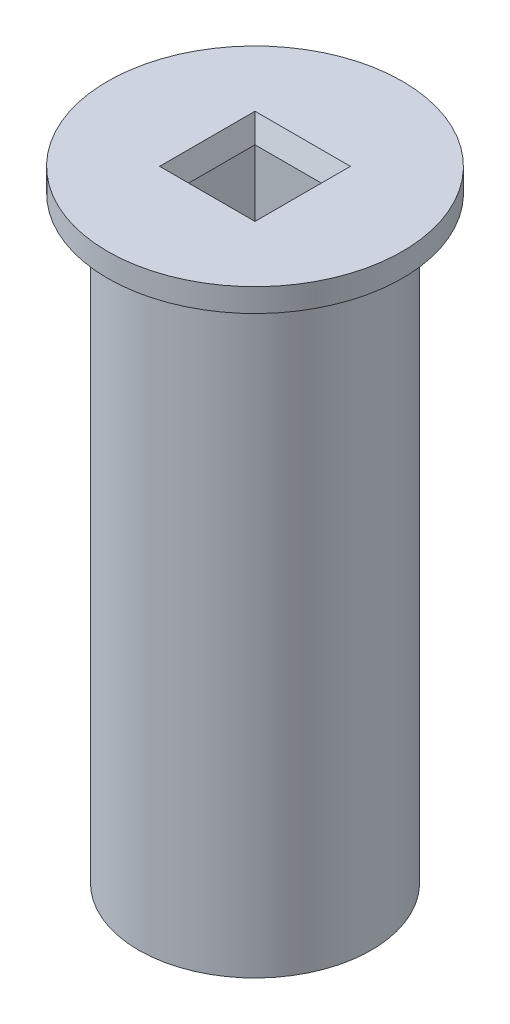
ISO-10303-21;
HEADER;
FILE_DESCRIPTION(('STEP AP214'),'2;1');
FILE_NAME('part.step','',(''),(''),'','','');
FILE_SCHEMA(('AUTOMOTIVE_DESIGN { 1 0 10303 214 1 1 1 1 }'));
ENDSEC;
DATA;
#1=APPLICATION_CONTEXT('core data for automotive mechanical design processes');
#2=APPLICATION_PROTOCOL_DEFINITION('international standard','automotive_design',2000,#1);
#3=PRODUCT_CONTEXT('',#1,'mechanical');
#4=PRODUCT('Part','Part','',(#3));
#5=PRODUCT_RELATED_PRODUCT_CATEGORY('part','',(#4));
#6=PRODUCT_DEFINITION_FORMATION('','',#4);
#7=PRODUCT_DEFINITION_CONTEXT('part definition',#1,'design');
#8=PRODUCT_DEFINITION('design','',#6,#7);
#9=PRODUCT_DEFINITION_SHAPE('','',#8);
#10=(LENGTH_UNIT() NAMED_UNIT(*) SI_UNIT(.MILLI.,.METRE.));
#11=(NAMED_UNIT(*) PLANE_ANGLE_UNIT() SI_UNIT($,.RADIAN.));
#12=(NAMED_UNIT(*) SI_UNIT($,.STERADIAN.) SOLID_ANGLE_UNIT());
#13=UNCERTAINTY_MEASURE_WITH_UNIT(LENGTH_MEASURE(1.E-05),#10,'distance_accuracy_value','');
#14=(GEOMETRIC_REPRESENTATION_CONTEXT(3) GLOBAL_UNCERTAINTY_ASSIGNED_CONTEXT((#13)) GLOBAL_UNIT_ASSIGNED_CONTEXT((#10,
#11,#12)) REPRESENTATION_CONTEXT('',''));
#15=CARTESIAN_POINT('',(0.,0.,0.));
#16=DIRECTION('',(0.,0.,1.));
#17=DIRECTION('',(1.,0.,0.));
#18=AXIS2_PLACEMENT_3D('',#15,#16,#17);
#19=CARTESIAN_POINT('',(0.,80.,0.));
#20=DIRECTION('',(0.,-1.,0.));
#21=DIRECTION('',(0.,0.,-1.));
#22=AXIS2_PLACEMENT_3D('',#19,#20,#21);
#23=CYLINDRICAL_SURFACE('',#22,15.);
#24=CARTESIAN_POINT('',(0.,0.,0.));
#25=DIRECTION('',(0.,1.,0.));
#26=DIRECTION('',(0.,0.,1.));
#27=AXIS2_PLACEMENT_3D('',#24,#25,#26);
#28=CIRCLE('',#27,15.);
#29=CARTESIAN_POINT('',(0.,0.,15.));
#30=VERTEX_POINT('',#29);
#31=EDGE_CURVE('E94',#30,#30,#28,.T.);
#32=ORIENTED_EDGE('',*,*,#31,.T.);
#33=EDGE_LOOP('',(#32));
#34=FACE_BOUND('',#33,.T.);
#35=CARTESIAN_POINT('',(0.,77.,0.));
#36=DIRECTION('',(0.,1.,0.));
#37=DIRECTION('',(0.,0.,1.));
#38=AXIS2_PLACEMENT_3D('',#35,#36,#37);
#39=CIRCLE('',#38,15.);
#40=CARTESIAN_POINT('',(0.,77.,15.));
#41=VERTEX_POINT('',#40);
#42=EDGE_CURVE('E115',#41,#41,#39,.T.);
#43=ORIENTED_EDGE('',*,*,#42,.F.);
#44=EDGE_LOOP('',(#43));
#45=FACE_BOUND('',#44,.T.);
#46=ADVANCED_FACE('F35',(#34,#45),#23,.T.);
#47=CARTESIAN_POINT('',(0.,80.,0.));
#48=DIRECTION('',(0.,1.,0.));
#49=DIRECTION('',(0.,0.,1.));
#50=AXIS2_PLACEMENT_3D('',#47,#48,#49);
#51=PLANE('',#50);
#52=DIRECTION('',(1.,0.,0.));
#53=VECTOR('',#52,1.);
#54=CARTESIAN_POINT('',(0.,80.,-6.14999999999999));
#55=LINE('',#54,#53);
#56=CARTESIAN_POINT('',(-6.14999999999999,80.,-6.14999999999999));
#57=VERTEX_POINT('',#56);
#58=CARTESIAN_POINT('',(6.15,80.,-6.14999999999999));
#59=VERTEX_POINT('',#58);
#60=EDGE_CURVE('E130',#57,#59,#55,.T.);
#61=ORIENTED_EDGE('',*,*,#60,.T.);
#62=DIRECTION('',(0.,0.,1.));
#63=VECTOR('',#62,1.);
#64=CARTESIAN_POINT('',(6.15,80.,0.));
#65=LINE('',#64,#63);
#66=CARTESIAN_POINT('',(6.15,80.,6.15));
#67=VERTEX_POINT('',#66);
#68=EDGE_CURVE('E136',#59,#67,#65,.T.);
#69=ORIENTED_EDGE('',*,*,#68,.T.);
#70=DIRECTION('',(-1.,0.,0.));
#71=VECTOR('',#70,1.);
#72=CARTESIAN_POINT('',(0.,80.,6.15));
#73=LINE('',#72,#71);
#74=CARTESIAN_POINT('',(-6.14999999999999,80.,6.15));
#75=VERTEX_POINT('',#74);
#76=EDGE_CURVE('E134',#67,#75,#73,.T.);
#77=ORIENTED_EDGE('',*,*,#76,.T.);
#78=DIRECTION('',(0.,0.,-1.));
#79=VECTOR('',#78,1.);
#80=CARTESIAN_POINT('',(-6.14999999999999,80.,0.));
#81=LINE('',#80,#79);
#82=EDGE_CURVE('E132',#75,#57,#81,.T.);
#83=ORIENTED_EDGE('',*,*,#82,.T.);
#84=EDGE_LOOP('',(#61,#69,#77,#83));
#85=FACE_BOUND('',#84,.T.);
#86=CARTESIAN_POINT('',(0.,80.,0.));
#87=DIRECTION('',(0.,1.,0.));
#88=DIRECTION('',(0.,0.,1.));
#89=AXIS2_PLACEMENT_3D('',#86,#87,#88);
#90=CIRCLE('',#89,19.);
#91=CARTESIAN_POINT('',(0.,80.,19.));
#92=VERTEX_POINT('',#91);
#93=EDGE_CURVE('E112',#92,#92,#90,.T.);
#94=ORIENTED_EDGE('',*,*,#93,.T.);
#95=EDGE_LOOP('',(#94));
#96=FACE_BOUND('',#95,.T.);
#97=ADVANCED_FACE('F157',(#85,#96),#51,.T.);
#98=CARTESIAN_POINT('',(0.,0.,0.));
#99=DIRECTION('',(0.,1.,0.));
#100=DIRECTION('',(0.,0.,1.));
#101=AXIS2_PLACEMENT_3D('',#98,#99,#100);
#102=PLANE('',#101);
#103=ORIENTED_EDGE('',*,*,#31,.F.);
#104=EDGE_LOOP('',(#103));
#105=FACE_BOUND('',#104,.T.);
#106=DIRECTION('',(0.,0.,1.));
#107=VECTOR('',#106,1.);
#108=CARTESIAN_POINT('',(-5.15,0.,5.15));
#109=LINE('',#108,#107);
#110=CARTESIAN_POINT('',(-5.15,0.,-5.15));
#111=VERTEX_POINT('',#110);
#112=CARTESIAN_POINT('',(-5.15,0.,5.15));
#113=VERTEX_POINT('',#112);
#114=EDGE_CURVE('E90',#111,#113,#109,.T.);
#115=ORIENTED_EDGE('',*,*,#114,.T.);
#116=DIRECTION('',(1.,0.,0.));
#117=VECTOR('',#116,1.);
#118=CARTESIAN_POINT('',(5.15,0.,5.15));
#119=LINE('',#118,#117);
#120=CARTESIAN_POINT('',(5.15,0.,5.15));
#121=VERTEX_POINT('',#120);
#122=EDGE_CURVE('E98',#113,#121,#119,.T.);
#123=ORIENTED_EDGE('',*,*,#122,.T.);
#124=DIRECTION('',(0.,0.,-1.));
#125=VECTOR('',#124,1.);
#126=CARTESIAN_POINT('',(5.15,0.,5.15));
#127=LINE('',#126,#125);
#128=CARTESIAN_POINT('',(5.15,0.,-5.15));
#129=VERTEX_POINT('',#128);
#130=EDGE_CURVE('E104',#121,#129,#127,.T.);
#131=ORIENTED_EDGE('',*,*,#130,.T.);
#132=DIRECTION('',(-1.,0.,0.));
#133=VECTOR('',#132,1.);
#134=CARTESIAN_POINT('',(5.15,0.,-5.15));
#135=LINE('',#134,#133);
#136=EDGE_CURVE('E108',#129,#111,#135,.T.);
#137=ORIENTED_EDGE('',*,*,#136,.T.);
#138=EDGE_LOOP('',(#115,#123,#131,#137));
#139=FACE_BOUND('',#138,.T.);
#140=ADVANCED_FACE('F106',(#105,#139),#102,.F.);
#141=CARTESIAN_POINT('',(-5.15,80.,5.15));
#142=DIRECTION('',(1.,0.,0.));
#143=DIRECTION('',(0.,0.,-1.));
#144=AXIS2_PLACEMENT_3D('',#141,#142,#143);
#145=PLANE('',#144);
#146=DIRECTION('',(0.,-1.,0.));
#147=VECTOR('',#146,1.);
#148=CARTESIAN_POINT('',(-5.15,80.,-5.15));
#149=LINE('',#148,#147);
#150=CARTESIAN_POINT('',(-5.15,77.2525225805454,-5.15));
#151=VERTEX_POINT('',#150);
#152=EDGE_CURVE('E120',#151,#111,#149,.T.);
#153=ORIENTED_EDGE('',*,*,#152,.F.);
#154=DIRECTION('',(0.,0.,1.));
#155=VECTOR('',#154,1.);
#156=CARTESIAN_POINT('',(-5.15,77.2525225805454,5.15));
#157=LINE('',#156,#155);
#158=CARTESIAN_POINT('',(-5.15,77.2525225805454,5.15));
#159=VERTEX_POINT('',#158);
#160=EDGE_CURVE('E44',#151,#159,#157,.T.);
#161=ORIENTED_EDGE('',*,*,#160,.T.);
#162=DIRECTION('',(0.,-1.,0.));
#163=VECTOR('',#162,1.);
#164=CARTESIAN_POINT('',(-5.15,80.,5.15));
#165=LINE('',#164,#163);
#166=EDGE_CURVE('E86',#159,#113,#165,.T.);
#167=ORIENTED_EDGE('',*,*,#166,.T.);
#168=ORIENTED_EDGE('',*,*,#114,.F.);
#169=EDGE_LOOP('',(#153,#161,#167,#168));
#170=FACE_BOUND('',#169,.T.);
#171=ADVANCED_FACE('F88',(#170),#145,.T.);
#172=CARTESIAN_POINT('',(5.15,80.,5.15));
#173=DIRECTION('',(0.,0.,-1.));
#174=DIRECTION('',(-1.,0.,0.));
#175=AXIS2_PLACEMENT_3D('',#172,#173,#174);
#176=PLANE('',#175);
#177=ORIENTED_EDGE('',*,*,#166,.F.);
#178=DIRECTION('',(1.,0.,0.));
#179=VECTOR('',#178,1.);
#180=CARTESIAN_POINT('',(5.15,77.2525225805454,5.15));
#181=LINE('',#180,#179);
#182=CARTESIAN_POINT('',(5.15,77.2525225805454,5.15));
#183=VERTEX_POINT('',#182);
#184=EDGE_CURVE('E139',#159,#183,#181,.T.);
#185=ORIENTED_EDGE('',*,*,#184,.T.);
#186=DIRECTION('',(0.,-1.,0.));
#187=VECTOR('',#186,1.);
#188=CARTESIAN_POINT('',(5.15,80.,5.15));
#189=LINE('',#188,#187);
#190=EDGE_CURVE('E95',#183,#121,#189,.T.);
#191=ORIENTED_EDGE('',*,*,#190,.T.);
#192=ORIENTED_EDGE('',*,*,#122,.F.);
#193=EDGE_LOOP('',(#177,#185,#191,#192));
#194=FACE_BOUND('',#193,.T.);
#195=ADVANCED_FACE('F99',(#194),#176,.T.);
#196=CARTESIAN_POINT('',(5.15,80.,5.15));
#197=DIRECTION('',(-1.,0.,0.));
#198=DIRECTION('',(0.,0.,1.));
#199=AXIS2_PLACEMENT_3D('',#196,#197,#198);
#200=PLANE('',#199);
#201=ORIENTED_EDGE('',*,*,#190,.F.);
#202=DIRECTION('',(0.,0.,-1.));
#203=VECTOR('',#202,1.);
#204=CARTESIAN_POINT('',(5.15,77.2525225805454,5.15));
#205=LINE('',#204,#203);
#206=CARTESIAN_POINT('',(5.15,77.2525225805454,-5.15));
#207=VERTEX_POINT('',#206);
#208=EDGE_CURVE('E127',#183,#207,#205,.T.);
#209=ORIENTED_EDGE('',*,*,#208,.T.);
#210=DIRECTION('',(0.,-1.,0.));
#211=VECTOR('',#210,1.);
#212=CARTESIAN_POINT('',(5.15,80.,-5.15));
#213=LINE('',#212,#211);
#214=EDGE_CURVE('E122',#207,#129,#213,.T.);
#215=ORIENTED_EDGE('',*,*,#214,.T.);
#216=ORIENTED_EDGE('',*,*,#130,.F.);
#217=EDGE_LOOP('',(#201,#209,#215,#216));
#218=FACE_BOUND('',#217,.T.);
#219=ADVANCED_FACE('F246',(#218),#200,.T.);
#220=CARTESIAN_POINT('',(5.15,80.,-5.15));
#221=DIRECTION('',(0.,0.,1.));
#222=DIRECTION('',(1.,0.,0.));
#223=AXIS2_PLACEMENT_3D('',#220,#221,#222);
#224=PLANE('',#223);
#225=ORIENTED_EDGE('',*,*,#214,.F.);
#226=DIRECTION('',(-1.,0.,0.));
#227=VECTOR('',#226,1.);
#228=CARTESIAN_POINT('',(5.15,77.2525225805454,-5.15));
#229=LINE('',#228,#227);
#230=EDGE_CURVE('E11',#207,#151,#229,.T.);
#231=ORIENTED_EDGE('',*,*,#230,.T.);
#232=ORIENTED_EDGE('',*,*,#152,.T.);
#233=ORIENTED_EDGE('',*,*,#136,.F.);
#234=EDGE_LOOP('',(#225,#231,#232,#233));
#235=FACE_BOUND('',#234,.T.);
#236=ADVANCED_FACE('F170',(#235),#224,.T.);
#237=CARTESIAN_POINT('',(0.,77.,0.));
#238=DIRECTION('',(0.,1.,0.));
#239=DIRECTION('',(0.,0.,1.));
#240=AXIS2_PLACEMENT_3D('',#237,#238,#239);
#241=PLANE('',#240);
#242=CARTESIAN_POINT('',(0.,77.,0.));
#243=DIRECTION('',(0.,1.,0.));
#244=DIRECTION('',(0.,0.,1.));
#245=AXIS2_PLACEMENT_3D('',#242,#243,#244);
#246=CIRCLE('',#245,19.);
#247=CARTESIAN_POINT('',(0.,77.,19.));
#248=VERTEX_POINT('',#247);
#249=EDGE_CURVE('E109',#248,#248,#246,.T.);
#250=ORIENTED_EDGE('',*,*,#249,.F.);
#251=EDGE_LOOP('',(#250));
#252=FACE_BOUND('',#251,.T.);
#253=ORIENTED_EDGE('',*,*,#42,.T.);
#254=EDGE_LOOP('',(#253));
#255=FACE_BOUND('',#254,.T.);
#256=ADVANCED_FACE('F161',(#252,#255),#241,.F.);
#257=CARTESIAN_POINT('',(0.,77.,0.));
#258=DIRECTION('',(0.,1.,0.));
#259=DIRECTION('',(0.,0.,1.));
#260=AXIS2_PLACEMENT_3D('',#257,#258,#259);
#261=CYLINDRICAL_SURFACE('',#260,19.);
#262=ORIENTED_EDGE('',*,*,#249,.T.);
#263=EDGE_LOOP('',(#262));
#264=FACE_BOUND('',#263,.T.);
#265=ORIENTED_EDGE('',*,*,#93,.F.);
#266=EDGE_LOOP('',(#265));
#267=FACE_BOUND('',#266,.T.);
#268=ADVANCED_FACE('F159',(#264,#267),#261,.T.);
#269=CARTESIAN_POINT('',(-5.15,77.2525225805454,5.15));
#270=DIRECTION('',(-0.939692620785909,-0.342020143325667,0.));
#271=DIRECTION('',(0.,0.,1.));
#272=AXIS2_PLACEMENT_3D('',#269,#270,#271);
#273=PLANE('',#272);
#274=DIRECTION('',(0.323615577118183,-0.889126490715989,0.323615577118183));
#275=VECTOR('',#274,1.);
#276=CARTESIAN_POINT('',(-4.07131146993859,74.2888502015769,-4.07131146993859));
#277=LINE('',#276,#275);
#278=EDGE_CURVE('E145',#57,#151,#277,.T.);
#279=ORIENTED_EDGE('',*,*,#278,.F.);
#280=ORIENTED_EDGE('',*,*,#82,.F.);
#281=DIRECTION('',(0.323615577118183,-0.889126490715989,-0.323615577118183));
#282=VECTOR('',#281,1.);
#283=CARTESIAN_POINT('',(-4.07131146993859,74.2888502015769,4.07131146993859));
#284=LINE('',#283,#282);
#285=EDGE_CURVE('E39',#159,#75,#284,.F.);
#286=ORIENTED_EDGE('',*,*,#285,.F.);
#287=ORIENTED_EDGE('',*,*,#160,.F.);
#288=EDGE_LOOP('',(#279,#280,#286,#287));
#289=FACE_BOUND('',#288,.T.);
#290=ADVANCED_FACE('F37',(#289),#273,.F.);
#291=CARTESIAN_POINT('',(5.15,77.2525225805454,5.15));
#292=DIRECTION('',(0.,-0.342020143325667,0.939692620785909));
#293=DIRECTION('',(1.,0.,0.));
#294=AXIS2_PLACEMENT_3D('',#291,#292,#293);
#295=PLANE('',#294);
#296=ORIENTED_EDGE('',*,*,#285,.T.);
#297=ORIENTED_EDGE('',*,*,#76,.F.);
#298=DIRECTION('',(-0.323615577118183,-0.889126490715989,-0.323615577118183));
#299=VECTOR('',#298,1.);
#300=CARTESIAN_POINT('',(5.15,77.2525225805454,5.15));
#301=LINE('',#300,#299);
#302=EDGE_CURVE('E144',#183,#67,#301,.F.);
#303=ORIENTED_EDGE('',*,*,#302,.F.);
#304=ORIENTED_EDGE('',*,*,#184,.F.);
#305=EDGE_LOOP('',(#296,#297,#303,#304));
#306=FACE_BOUND('',#305,.T.);
#307=ADVANCED_FACE('F168',(#306),#295,.F.);
#308=CARTESIAN_POINT('',(5.15,77.2525225805454,-5.15));
#309=DIRECTION('',(0.,-0.342020143325667,-0.939692620785909));
#310=DIRECTION('',(-1.,0.,0.));
#311=AXIS2_PLACEMENT_3D('',#308,#309,#310);
#312=PLANE('',#311);
#313=ORIENTED_EDGE('',*,*,#278,.T.);
#314=ORIENTED_EDGE('',*,*,#230,.F.);
#315=DIRECTION('',(0.323615577118183,0.889126490715989,-0.323615577118183));
#316=VECTOR('',#315,1.);
#317=CARTESIAN_POINT('',(4.07131146993859,74.2888502015769,-4.07131146993859));
#318=LINE('',#317,#316);
#319=EDGE_CURVE('E142',#59,#207,#318,.F.);
#320=ORIENTED_EDGE('',*,*,#319,.F.);
#321=ORIENTED_EDGE('',*,*,#60,.F.);
#322=EDGE_LOOP('',(#313,#314,#320,#321));
#323=FACE_BOUND('',#322,.T.);
#324=ADVANCED_FACE('F188',(#323),#312,.F.);
#325=CARTESIAN_POINT('',(5.15,77.2525225805454,5.15));
#326=DIRECTION('',(0.939692620785909,-0.342020143325667,0.));
#327=DIRECTION('',(0.,0.,-1.));
#328=AXIS2_PLACEMENT_3D('',#325,#326,#327);
#329=PLANE('',#328);
#330=ORIENTED_EDGE('',*,*,#302,.T.);
#331=ORIENTED_EDGE('',*,*,#68,.F.);
#332=ORIENTED_EDGE('',*,*,#319,.T.);
#333=ORIENTED_EDGE('',*,*,#208,.F.);
#334=EDGE_LOOP('',(#330,#331,#332,#333));
#335=FACE_BOUND('',#334,.T.);
#336=ADVANCED_FACE('F185',(#335),#329,.F.);
#337=CLOSED_SHELL('',(#46,#97,#140,#171,#195,#219,#236,#256,#268,#290,#307,#324,#336));
#338=MANIFOLD_SOLID_BREP('B2',#337);
#339=ADVANCED_BREP_SHAPE_REPRESENTATION('',(#18,#338),#14);
#340=SHAPE_DEFINITION_REPRESENTATION(#9,#339);
ENDSEC;
END-ISO-10303-21;
